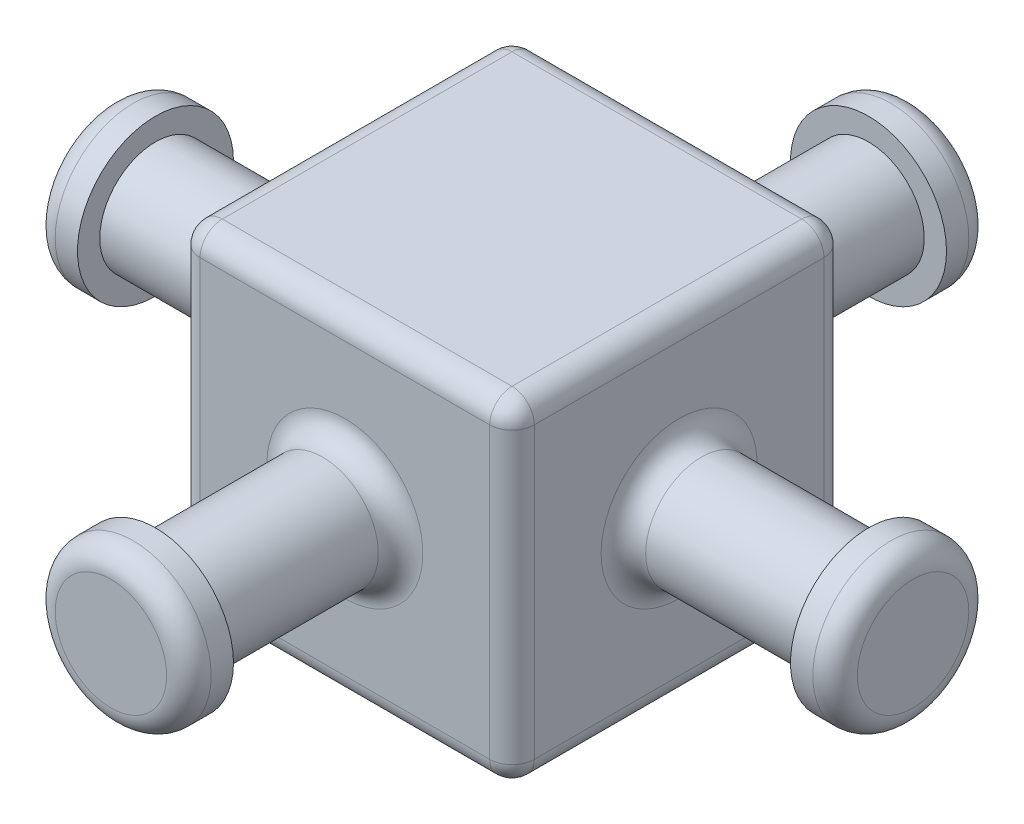
ISO-10303-21;
HEADER;
FILE_DESCRIPTION(('STEP AP214'),'2;1');
FILE_NAME('part.step','',(''),(''),'','','');
FILE_SCHEMA(('AUTOMOTIVE_DESIGN { 1 0 10303 214 1 1 1 1 }'));
ENDSEC;
DATA;
#1=APPLICATION_CONTEXT('core data for automotive mechanical design processes');
#2=APPLICATION_PROTOCOL_DEFINITION('international standard','automotive_design',2000,#1);
#3=PRODUCT_CONTEXT('',#1,'mechanical');
#4=PRODUCT('Part','Part','',(#3));
#5=PRODUCT_RELATED_PRODUCT_CATEGORY('part','',(#4));
#6=PRODUCT_DEFINITION_FORMATION('','',#4);
#7=PRODUCT_DEFINITION_CONTEXT('part definition',#1,'design');
#8=PRODUCT_DEFINITION('design','',#6,#7);
#9=PRODUCT_DEFINITION_SHAPE('','',#8);
#10=(LENGTH_UNIT() NAMED_UNIT(*) SI_UNIT(.MILLI.,.METRE.));
#11=(NAMED_UNIT(*) PLANE_ANGLE_UNIT() SI_UNIT($,.RADIAN.));
#12=(NAMED_UNIT(*) SI_UNIT($,.STERADIAN.) SOLID_ANGLE_UNIT());
#13=UNCERTAINTY_MEASURE_WITH_UNIT(LENGTH_MEASURE(1.E-05),#10,'distance_accuracy_value','');
#14=(GEOMETRIC_REPRESENTATION_CONTEXT(3) GLOBAL_UNCERTAINTY_ASSIGNED_CONTEXT((#13)) GLOBAL_UNIT_ASSIGNED_CONTEXT((#10,
#11,#12)) REPRESENTATION_CONTEXT('',''));
#15=CARTESIAN_POINT('',(0.,0.,0.));
#16=DIRECTION('',(0.,0.,1.));
#17=DIRECTION('',(1.,0.,0.));
#18=AXIS2_PLACEMENT_3D('',#15,#16,#17);
#19=CARTESIAN_POINT('',(0.,0.,20.32));
#20=DIRECTION('',(0.,0.,-1.));
#21=DIRECTION('',(-1.,0.,0.));
#22=AXIS2_PLACEMENT_3D('',#19,#20,#21);
#23=CYLINDRICAL_SURFACE('',#22,3.175);
#24=CARTESIAN_POINT('',(0.,0.,10.795));
#25=DIRECTION('',(0.,0.,-1.));
#26=DIRECTION('',(-1.,0.,0.));
#27=AXIS2_PLACEMENT_3D('',#24,#25,#26);
#28=CIRCLE('',#27,3.175);
#29=CARTESIAN_POINT('',(-3.175,0.,10.795));
#30=VERTEX_POINT('',#29);
#31=EDGE_CURVE('E165',#30,#30,#28,.F.);
#32=ORIENTED_EDGE('',*,*,#31,.T.);
#33=EDGE_LOOP('',(#32));
#34=FACE_BOUND('',#33,.T.);
#35=CARTESIAN_POINT('',(0.,0.,20.32));
#36=DIRECTION('',(0.,0.,1.));
#37=DIRECTION('',(1.,0.,0.));
#38=AXIS2_PLACEMENT_3D('',#35,#36,#37);
#39=CIRCLE('',#38,3.175);
#40=CARTESIAN_POINT('',(3.175,0.,20.32));
#41=VERTEX_POINT('',#40);
#42=EDGE_CURVE('E308',#41,#41,#39,.T.);
#43=ORIENTED_EDGE('',*,*,#42,.F.);
#44=EDGE_LOOP('',(#43));
#45=FACE_BOUND('',#44,.T.);
#46=ADVANCED_FACE('F34',(#34,#45),#23,.T.);
#47=CARTESIAN_POINT('',(0.,0.,20.32));
#48=DIRECTION('',(0.,0.,1.));
#49=DIRECTION('',(1.,0.,0.));
#50=AXIS2_PLACEMENT_3D('',#47,#48,#49);
#51=PLANE('',#50);
#52=CARTESIAN_POINT('',(0.,0.,20.32));
#53=DIRECTION('',(0.,0.,1.));
#54=DIRECTION('',(1.,0.,0.));
#55=AXIS2_PLACEMENT_3D('',#52,#53,#54);
#56=CIRCLE('',#55,4.445);
#57=CARTESIAN_POINT('',(4.445,0.,20.32));
#58=VERTEX_POINT('',#57);
#59=EDGE_CURVE('E305',#58,#58,#56,.T.);
#60=ORIENTED_EDGE('',*,*,#59,.F.);
#61=EDGE_LOOP('',(#60));
#62=FACE_BOUND('',#61,.T.);
#63=ORIENTED_EDGE('',*,*,#42,.T.);
#64=EDGE_LOOP('',(#63));
#65=FACE_BOUND('',#64,.T.);
#66=ADVANCED_FACE('F387',(#62,#65),#51,.F.);
#67=CARTESIAN_POINT('',(0.,0.,22.86));
#68=DIRECTION('',(0.,0.,-1.));
#69=DIRECTION('',(-1.,0.,0.));
#70=AXIS2_PLACEMENT_3D('',#67,#68,#69);
#71=CYLINDRICAL_SURFACE('',#70,4.445);
#72=CARTESIAN_POINT('',(0.,0.,21.59));
#73=DIRECTION('',(0.,0.,1.));
#74=DIRECTION('',(1.,0.,0.));
#75=AXIS2_PLACEMENT_3D('',#72,#73,#74);
#76=CIRCLE('',#75,4.445);
#77=CARTESIAN_POINT('',(4.445,0.,21.59));
#78=VERTEX_POINT('',#77);
#79=EDGE_CURVE('E314',#78,#78,#76,.F.);
#80=ORIENTED_EDGE('',*,*,#79,.T.);
#81=EDGE_LOOP('',(#80));
#82=FACE_BOUND('',#81,.T.);
#83=ORIENTED_EDGE('',*,*,#59,.T.);
#84=EDGE_LOOP('',(#83));
#85=FACE_BOUND('',#84,.T.);
#86=ADVANCED_FACE('F394',(#82,#85),#71,.T.);
#87=CARTESIAN_POINT('',(0.,0.,22.86));
#88=DIRECTION('',(0.,0.,1.));
#89=DIRECTION('',(1.,0.,0.));
#90=AXIS2_PLACEMENT_3D('',#87,#88,#89);
#91=PLANE('',#90);
#92=CARTESIAN_POINT('',(0.,0.,22.86));
#93=DIRECTION('',(0.,0.,1.));
#94=DIRECTION('',(1.,0.,0.));
#95=AXIS2_PLACEMENT_3D('',#92,#93,#94);
#96=CIRCLE('',#95,3.175);
#97=CARTESIAN_POINT('',(3.175,0.,22.86));
#98=VERTEX_POINT('',#97);
#99=EDGE_CURVE('E311',#98,#98,#96,.T.);
#100=ORIENTED_EDGE('',*,*,#99,.T.);
#101=EDGE_LOOP('',(#100));
#102=FACE_BOUND('',#101,.T.);
#103=ADVANCED_FACE('F511',(#102),#91,.T.);
#104=CARTESIAN_POINT('',(0.,0.,21.59));
#105=DIRECTION('',(0.,0.,1.));
#106=DIRECTION('',(1.,0.,0.));
#107=AXIS2_PLACEMENT_3D('',#104,#105,#106);
#108=TOROIDAL_SURFACE('',#107,3.175,1.27);
#109=ORIENTED_EDGE('',*,*,#79,.F.);
#110=EDGE_LOOP('',(#109));
#111=FACE_BOUND('',#110,.T.);
#112=ORIENTED_EDGE('',*,*,#99,.F.);
#113=EDGE_LOOP('',(#112));
#114=FACE_BOUND('',#113,.T.);
#115=ADVANCED_FACE('F513',(#111,#114),#108,.T.);
#116=CARTESIAN_POINT('',(9.525,-9.525,9.525));
#117=DIRECTION('',(0.,0.,-1.));
#118=DIRECTION('',(-1.,0.,0.));
#119=AXIS2_PLACEMENT_3D('',#116,#117,#118);
#120=PLANE('',#119);
#121=CARTESIAN_POINT('',(0.,0.,9.525));
#122=DIRECTION('',(0.,0.,-1.));
#123=DIRECTION('',(-1.,0.,0.));
#124=AXIS2_PLACEMENT_3D('',#121,#122,#123);
#125=CIRCLE('',#124,4.445);
#126=CARTESIAN_POINT('',(-4.445,0.,9.525));
#127=VERTEX_POINT('',#126);
#128=EDGE_CURVE('E162',#127,#127,#125,.T.);
#129=ORIENTED_EDGE('',*,*,#128,.T.);
#130=EDGE_LOOP('',(#129));
#131=FACE_BOUND('',#130,.T.);
#132=DIRECTION('',(0.,-1.,0.));
#133=VECTOR('',#132,1.);
#134=CARTESIAN_POINT('',(-8.255,-9.525,9.525));
#135=LINE('',#134,#133);
#136=CARTESIAN_POINT('',(-8.255,8.255,9.525));
#137=VERTEX_POINT('',#136);
#138=CARTESIAN_POINT('',(-8.255,-8.255,9.525));
#139=VERTEX_POINT('',#138);
#140=EDGE_CURVE('E160',#137,#139,#135,.T.);
#141=ORIENTED_EDGE('',*,*,#140,.T.);
#142=DIRECTION('',(-1.,0.,0.));
#143=VECTOR('',#142,1.);
#144=CARTESIAN_POINT('',(9.525,-8.255,9.525));
#145=LINE('',#144,#143);
#146=CARTESIAN_POINT('',(8.255,-8.255,9.525));
#147=VERTEX_POINT('',#146);
#148=EDGE_CURVE('E130',#139,#147,#145,.F.);
#149=ORIENTED_EDGE('',*,*,#148,.T.);
#150=DIRECTION('',(0.,-1.,0.));
#151=VECTOR('',#150,1.);
#152=CARTESIAN_POINT('',(8.255,-9.525,9.525));
#153=LINE('',#152,#151);
#154=CARTESIAN_POINT('',(8.255,8.255,9.525));
#155=VERTEX_POINT('',#154);
#156=EDGE_CURVE('E149',#147,#155,#153,.F.);
#157=ORIENTED_EDGE('',*,*,#156,.T.);
#158=DIRECTION('',(-1.,0.,0.));
#159=VECTOR('',#158,1.);
#160=CARTESIAN_POINT('',(9.525,8.255,9.525));
#161=LINE('',#160,#159);
#162=EDGE_CURVE('E155',#155,#137,#161,.T.);
#163=ORIENTED_EDGE('',*,*,#162,.T.);
#164=EDGE_LOOP('',(#141,#149,#157,#163));
#165=FACE_BOUND('',#164,.T.);
#166=ADVANCED_FACE('F158',(#131,#165),#120,.F.);
#167=CARTESIAN_POINT('',(-9.525,0.,0.));
#168=DIRECTION('',(-1.,0.,0.));
#169=DIRECTION('',(0.,0.,1.));
#170=AXIS2_PLACEMENT_3D('',#167,#168,#169);
#171=PLANE('',#170);
#172=CARTESIAN_POINT('',(-9.525,0.,0.));
#173=DIRECTION('',(-1.,0.,0.));
#174=DIRECTION('',(0.,0.,1.));
#175=AXIS2_PLACEMENT_3D('',#172,#173,#174);
#176=CIRCLE('',#175,4.445);
#177=CARTESIAN_POINT('',(-9.525,0.,4.445));
#178=VERTEX_POINT('',#177);
#179=EDGE_CURVE('E191',#178,#178,#176,.F.);
#180=ORIENTED_EDGE('',*,*,#179,.T.);
#181=EDGE_LOOP('',(#180));
#182=FACE_BOUND('',#181,.T.);
#183=DIRECTION('',(0.,0.,-1.));
#184=VECTOR('',#183,1.);
#185=CARTESIAN_POINT('',(-9.525,-8.255,9.525));
#186=LINE('',#185,#184);
#187=CARTESIAN_POINT('',(-9.525,-8.255,-8.255));
#188=VERTEX_POINT('',#187);
#189=CARTESIAN_POINT('',(-9.525,-8.255,8.255));
#190=VERTEX_POINT('',#189);
#191=EDGE_CURVE('E186',#188,#190,#186,.F.);
#192=ORIENTED_EDGE('',*,*,#191,.T.);
#193=DIRECTION('',(0.,-1.,0.));
#194=VECTOR('',#193,1.);
#195=CARTESIAN_POINT('',(-9.525,9.525,8.255));
#196=LINE('',#195,#194);
#197=CARTESIAN_POINT('',(-9.525,8.255,8.255));
#198=VERTEX_POINT('',#197);
#199=EDGE_CURVE('E188',#190,#198,#196,.F.);
#200=ORIENTED_EDGE('',*,*,#199,.T.);
#201=DIRECTION('',(0.,0.,1.));
#202=VECTOR('',#201,1.);
#203=CARTESIAN_POINT('',(-9.525,8.255,-9.525));
#204=LINE('',#203,#202);
#205=CARTESIAN_POINT('',(-9.525,8.255,-8.255));
#206=VERTEX_POINT('',#205);
#207=EDGE_CURVE('E184',#198,#206,#204,.F.);
#208=ORIENTED_EDGE('',*,*,#207,.T.);
#209=DIRECTION('',(0.,1.,0.));
#210=VECTOR('',#209,1.);
#211=CARTESIAN_POINT('',(-9.525,-9.525,-8.255));
#212=LINE('',#211,#210);
#213=EDGE_CURVE('E182',#206,#188,#212,.F.);
#214=ORIENTED_EDGE('',*,*,#213,.T.);
#215=EDGE_LOOP('',(#192,#200,#208,#214));
#216=FACE_BOUND('',#215,.T.);
#217=ADVANCED_FACE('F428',(#182,#216),#171,.T.);
#218=CARTESIAN_POINT('',(9.525,-9.525,-9.525));
#219=DIRECTION('',(0.,0.,1.));
#220=DIRECTION('',(1.,0.,0.));
#221=AXIS2_PLACEMENT_3D('',#218,#219,#220);
#222=PLANE('',#221);
#223=CARTESIAN_POINT('',(0.,0.,-9.525));
#224=DIRECTION('',(0.,0.,1.));
#225=DIRECTION('',(1.,0.,0.));
#226=AXIS2_PLACEMENT_3D('',#223,#224,#225);
#227=CIRCLE('',#226,4.445);
#228=CARTESIAN_POINT('',(4.445,0.,-9.525));
#229=VERTEX_POINT('',#228);
#230=EDGE_CURVE('E212',#229,#229,#227,.T.);
#231=ORIENTED_EDGE('',*,*,#230,.T.);
#232=EDGE_LOOP('',(#231));
#233=FACE_BOUND('',#232,.T.);
#234=DIRECTION('',(-1.,0.,0.));
#235=VECTOR('',#234,1.);
#236=CARTESIAN_POINT('',(9.525,-8.255,-9.525));
#237=LINE('',#236,#235);
#238=CARTESIAN_POINT('',(8.255,-8.255,-9.525));
#239=VERTEX_POINT('',#238);
#240=CARTESIAN_POINT('',(-8.255,-8.255,-9.525));
#241=VERTEX_POINT('',#240);
#242=EDGE_CURVE('E207',#239,#241,#237,.T.);
#243=ORIENTED_EDGE('',*,*,#242,.T.);
#244=DIRECTION('',(0.,1.,0.));
#245=VECTOR('',#244,1.);
#246=CARTESIAN_POINT('',(-8.255,9.525,-9.525));
#247=LINE('',#246,#245);
#248=CARTESIAN_POINT('',(-8.255,8.255,-9.525));
#249=VERTEX_POINT('',#248);
#250=EDGE_CURVE('E210',#241,#249,#247,.T.);
#251=ORIENTED_EDGE('',*,*,#250,.T.);
#252=DIRECTION('',(-1.,0.,0.));
#253=VECTOR('',#252,1.);
#254=CARTESIAN_POINT('',(9.525,8.255,-9.525));
#255=LINE('',#254,#253);
#256=CARTESIAN_POINT('',(8.255,8.255,-9.525));
#257=VERTEX_POINT('',#256);
#258=EDGE_CURVE('E205',#249,#257,#255,.F.);
#259=ORIENTED_EDGE('',*,*,#258,.T.);
#260=DIRECTION('',(0.,1.,0.));
#261=VECTOR('',#260,1.);
#262=CARTESIAN_POINT('',(8.255,-9.525,-9.525));
#263=LINE('',#262,#261);
#264=EDGE_CURVE('E203',#257,#239,#263,.F.);
#265=ORIENTED_EDGE('',*,*,#264,.T.);
#266=EDGE_LOOP('',(#243,#251,#259,#265));
#267=FACE_BOUND('',#266,.T.);
#268=ADVANCED_FACE('F425',(#233,#267),#222,.F.);
#269=CARTESIAN_POINT('',(9.525,0.,0.));
#270=DIRECTION('',(-1.,0.,0.));
#271=DIRECTION('',(0.,0.,1.));
#272=AXIS2_PLACEMENT_3D('',#269,#270,#271);
#273=PLANE('',#272);
#274=CARTESIAN_POINT('',(9.525,0.,0.));
#275=DIRECTION('',(-1.,0.,0.));
#276=DIRECTION('',(0.,0.,1.));
#277=AXIS2_PLACEMENT_3D('',#274,#275,#276);
#278=CIRCLE('',#277,4.445);
#279=CARTESIAN_POINT('',(9.525,0.,4.445));
#280=VERTEX_POINT('',#279);
#281=EDGE_CURVE('E43',#280,#280,#278,.T.);
#282=ORIENTED_EDGE('',*,*,#281,.T.);
#283=EDGE_LOOP('',(#282));
#284=FACE_BOUND('',#283,.T.);
#285=DIRECTION('',(0.,-1.,0.));
#286=VECTOR('',#285,1.);
#287=CARTESIAN_POINT('',(9.525,0.,8.255));
#288=LINE('',#287,#286);
#289=CARTESIAN_POINT('',(9.525,8.255,8.255));
#290=VERTEX_POINT('',#289);
#291=CARTESIAN_POINT('',(9.525,-8.255,8.255));
#292=VERTEX_POINT('',#291);
#293=EDGE_CURVE('E51',#290,#292,#288,.T.);
#294=ORIENTED_EDGE('',*,*,#293,.T.);
#295=DIRECTION('',(0.,0.,-1.));
#296=VECTOR('',#295,1.);
#297=CARTESIAN_POINT('',(9.525,-8.255,0.));
#298=LINE('',#297,#296);
#299=CARTESIAN_POINT('',(9.525,-8.255,-8.255));
#300=VERTEX_POINT('',#299);
#301=EDGE_CURVE('E222',#292,#300,#298,.T.);
#302=ORIENTED_EDGE('',*,*,#301,.T.);
#303=DIRECTION('',(0.,1.,0.));
#304=VECTOR('',#303,1.);
#305=CARTESIAN_POINT('',(9.525,0.,-8.255));
#306=LINE('',#305,#304);
#307=CARTESIAN_POINT('',(9.525,8.255,-8.255));
#308=VERTEX_POINT('',#307);
#309=EDGE_CURVE('E218',#300,#308,#306,.T.);
#310=ORIENTED_EDGE('',*,*,#309,.T.);
#311=DIRECTION('',(0.,0.,1.));
#312=VECTOR('',#311,1.);
#313=CARTESIAN_POINT('',(9.525,8.255,0.));
#314=LINE('',#313,#312);
#315=EDGE_CURVE('E56',#308,#290,#314,.T.);
#316=ORIENTED_EDGE('',*,*,#315,.T.);
#317=EDGE_LOOP('',(#294,#302,#310,#316));
#318=FACE_BOUND('',#317,.T.);
#319=ADVANCED_FACE('F362',(#284,#318),#273,.F.);
#320=CARTESIAN_POINT('',(9.525,9.525,9.525));
#321=DIRECTION('',(0.,-1.,0.));
#322=DIRECTION('',(0.,0.,-1.));
#323=AXIS2_PLACEMENT_3D('',#320,#321,#322);
#324=PLANE('',#323);
#325=DIRECTION('',(0.,0.,1.));
#326=VECTOR('',#325,1.);
#327=CARTESIAN_POINT('',(-8.255,9.525,9.525));
#328=LINE('',#327,#326);
#329=CARTESIAN_POINT('',(-8.255,9.525,-8.255));
#330=VERTEX_POINT('',#329);
#331=CARTESIAN_POINT('',(-8.255,9.525,8.255));
#332=VERTEX_POINT('',#331);
#333=EDGE_CURVE('E198',#330,#332,#328,.T.);
#334=ORIENTED_EDGE('',*,*,#333,.T.);
#335=DIRECTION('',(-1.,0.,0.));
#336=VECTOR('',#335,1.);
#337=CARTESIAN_POINT('',(9.525,9.525,8.255));
#338=LINE('',#337,#336);
#339=CARTESIAN_POINT('',(8.255,9.525,8.255));
#340=VERTEX_POINT('',#339);
#341=EDGE_CURVE('E200',#332,#340,#338,.F.);
#342=ORIENTED_EDGE('',*,*,#341,.T.);
#343=DIRECTION('',(0.,0.,1.));
#344=VECTOR('',#343,1.);
#345=CARTESIAN_POINT('',(8.255,9.525,9.525));
#346=LINE('',#345,#344);
#347=CARTESIAN_POINT('',(8.255,9.525,-8.255));
#348=VERTEX_POINT('',#347);
#349=EDGE_CURVE('E194',#340,#348,#346,.F.);
#350=ORIENTED_EDGE('',*,*,#349,.T.);
#351=DIRECTION('',(-1.,0.,0.));
#352=VECTOR('',#351,1.);
#353=CARTESIAN_POINT('',(9.525,9.525,-8.255));
#354=LINE('',#353,#352);
#355=EDGE_CURVE('E196',#348,#330,#354,.T.);
#356=ORIENTED_EDGE('',*,*,#355,.T.);
#357=EDGE_LOOP('',(#334,#342,#350,#356));
#358=FACE_BOUND('',#357,.T.);
#359=ADVANCED_FACE('F445',(#358),#324,.F.);
#360=CARTESIAN_POINT('',(9.525,-9.525,9.525));
#361=DIRECTION('',(0.,1.,0.));
#362=DIRECTION('',(0.,0.,1.));
#363=AXIS2_PLACEMENT_3D('',#360,#361,#362);
#364=PLANE('',#363);
#365=DIRECTION('',(0.,0.,-1.));
#366=VECTOR('',#365,1.);
#367=CARTESIAN_POINT('',(8.255,-9.525,9.525));
#368=LINE('',#367,#366);
#369=CARTESIAN_POINT('',(8.255,-9.525,-8.255));
#370=VERTEX_POINT('',#369);
#371=CARTESIAN_POINT('',(8.255,-9.525,8.255));
#372=VERTEX_POINT('',#371);
#373=EDGE_CURVE('E172',#370,#372,#368,.F.);
#374=ORIENTED_EDGE('',*,*,#373,.T.);
#375=DIRECTION('',(-1.,0.,0.));
#376=VECTOR('',#375,1.);
#377=CARTESIAN_POINT('',(9.525,-9.525,8.255));
#378=LINE('',#377,#376);
#379=CARTESIAN_POINT('',(-8.255,-9.525,8.255));
#380=VERTEX_POINT('',#379);
#381=EDGE_CURVE('E133',#372,#380,#378,.T.);
#382=ORIENTED_EDGE('',*,*,#381,.T.);
#383=DIRECTION('',(0.,0.,-1.));
#384=VECTOR('',#383,1.);
#385=CARTESIAN_POINT('',(-8.255,-9.525,-9.525));
#386=LINE('',#385,#384);
#387=CARTESIAN_POINT('',(-8.255,-9.525,-8.255));
#388=VERTEX_POINT('',#387);
#389=EDGE_CURVE('E176',#380,#388,#386,.T.);
#390=ORIENTED_EDGE('',*,*,#389,.T.);
#391=DIRECTION('',(-1.,0.,0.));
#392=VECTOR('',#391,1.);
#393=CARTESIAN_POINT('',(9.525,-9.525,-8.255));
#394=LINE('',#393,#392);
#395=EDGE_CURVE('E174',#388,#370,#394,.F.);
#396=ORIENTED_EDGE('',*,*,#395,.T.);
#397=EDGE_LOOP('',(#374,#382,#390,#396));
#398=FACE_BOUND('',#397,.T.);
#399=ADVANCED_FACE('F356',(#398),#364,.F.);
#400=CARTESIAN_POINT('',(22.86,0.,0.));
#401=DIRECTION('',(1.,0.,0.));
#402=DIRECTION('',(0.,0.,-1.));
#403=AXIS2_PLACEMENT_3D('',#400,#401,#402);
#404=PLANE('',#403);
#405=CARTESIAN_POINT('',(22.86,0.,0.));
#406=DIRECTION('',(1.,0.,0.));
#407=DIRECTION('',(0.,0.,-1.));
#408=AXIS2_PLACEMENT_3D('',#405,#406,#407);
#409=CIRCLE('',#408,3.175);
#410=CARTESIAN_POINT('',(22.86,0.,-3.175));
#411=VERTEX_POINT('',#410);
#412=EDGE_CURVE('E323',#411,#411,#409,.T.);
#413=ORIENTED_EDGE('',*,*,#412,.T.);
#414=EDGE_LOOP('',(#413));
#415=FACE_BOUND('',#414,.T.);
#416=ADVANCED_FACE('F488',(#415),#404,.T.);
#417=CARTESIAN_POINT('',(21.59,0.,0.));
#418=DIRECTION('',(1.,0.,0.));
#419=DIRECTION('',(0.,0.,-1.));
#420=AXIS2_PLACEMENT_3D('',#417,#418,#419);
#421=TOROIDAL_SURFACE('',#420,3.175,1.27);
#422=CARTESIAN_POINT('',(21.59,0.,0.));
#423=DIRECTION('',(1.,0.,0.));
#424=DIRECTION('',(0.,0.,-1.));
#425=AXIS2_PLACEMENT_3D('',#422,#423,#424);
#426=CIRCLE('',#425,4.445);
#427=CARTESIAN_POINT('',(21.59,0.,-4.445));
#428=VERTEX_POINT('',#427);
#429=EDGE_CURVE('E326',#428,#428,#426,.F.);
#430=ORIENTED_EDGE('',*,*,#429,.F.);
#431=EDGE_LOOP('',(#430));
#432=FACE_BOUND('',#431,.T.);
#433=ORIENTED_EDGE('',*,*,#412,.F.);
#434=EDGE_LOOP('',(#433));
#435=FACE_BOUND('',#434,.T.);
#436=ADVANCED_FACE('F491',(#432,#435),#421,.T.);
#437=CARTESIAN_POINT('',(22.86,0.,0.));
#438=DIRECTION('',(-1.,0.,0.));
#439=DIRECTION('',(0.,0.,1.));
#440=AXIS2_PLACEMENT_3D('',#437,#438,#439);
#441=CYLINDRICAL_SURFACE('',#440,4.445);
#442=ORIENTED_EDGE('',*,*,#429,.T.);
#443=EDGE_LOOP('',(#442));
#444=FACE_BOUND('',#443,.T.);
#445=CARTESIAN_POINT('',(20.32,0.,0.));
#446=DIRECTION('',(1.,0.,0.));
#447=DIRECTION('',(0.,0.,-1.));
#448=AXIS2_PLACEMENT_3D('',#445,#446,#447);
#449=CIRCLE('',#448,4.445);
#450=CARTESIAN_POINT('',(20.32,0.,-4.445));
#451=VERTEX_POINT('',#450);
#452=EDGE_CURVE('E291',#451,#451,#449,.T.);
#453=ORIENTED_EDGE('',*,*,#452,.T.);
#454=EDGE_LOOP('',(#453));
#455=FACE_BOUND('',#454,.T.);
#456=ADVANCED_FACE('F496',(#444,#455),#441,.T.);
#457=CARTESIAN_POINT('',(20.32,0.,0.));
#458=DIRECTION('',(1.,0.,0.));
#459=DIRECTION('',(0.,0.,-1.));
#460=AXIS2_PLACEMENT_3D('',#457,#458,#459);
#461=PLANE('',#460);
#462=ORIENTED_EDGE('',*,*,#452,.F.);
#463=EDGE_LOOP('',(#462));
#464=FACE_BOUND('',#463,.T.);
#465=CARTESIAN_POINT('',(20.32,0.,0.));
#466=DIRECTION('',(1.,0.,0.));
#467=DIRECTION('',(0.,0.,-1.));
#468=AXIS2_PLACEMENT_3D('',#465,#466,#467);
#469=CIRCLE('',#468,3.175);
#470=CARTESIAN_POINT('',(20.32,0.,-3.175));
#471=VERTEX_POINT('',#470);
#472=EDGE_CURVE('E296',#471,#471,#469,.T.);
#473=ORIENTED_EDGE('',*,*,#472,.T.);
#474=EDGE_LOOP('',(#473));
#475=FACE_BOUND('',#474,.T.);
#476=ADVANCED_FACE('F493',(#464,#475),#461,.F.);
#477=CARTESIAN_POINT('',(20.32,0.,0.));
#478=DIRECTION('',(-1.,0.,0.));
#479=DIRECTION('',(0.,0.,1.));
#480=AXIS2_PLACEMENT_3D('',#477,#478,#479);
#481=CYLINDRICAL_SURFACE('',#480,3.175);
#482=CARTESIAN_POINT('',(10.795,0.,0.));
#483=DIRECTION('',(-1.,0.,0.));
#484=DIRECTION('',(0.,0.,1.));
#485=AXIS2_PLACEMENT_3D('',#482,#483,#484);
#486=CIRCLE('',#485,3.175);
#487=CARTESIAN_POINT('',(10.795,0.,3.175));
#488=VERTEX_POINT('',#487);
#489=EDGE_CURVE('E11',#488,#488,#486,.F.);
#490=ORIENTED_EDGE('',*,*,#489,.T.);
#491=EDGE_LOOP('',(#490));
#492=FACE_BOUND('',#491,.T.);
#493=ORIENTED_EDGE('',*,*,#472,.F.);
#494=EDGE_LOOP('',(#493));
#495=FACE_BOUND('',#494,.T.);
#496=ADVANCED_FACE('F476',(#492,#495),#481,.T.);
#497=CARTESIAN_POINT('',(0.,0.,-22.86));
#498=DIRECTION('',(0.,0.,-1.));
#499=DIRECTION('',(1.,0.,0.));
#500=AXIS2_PLACEMENT_3D('',#497,#498,#499);
#501=PLANE('',#500);
#502=CARTESIAN_POINT('',(0.,0.,-22.86));
#503=DIRECTION('',(0.,0.,-1.));
#504=DIRECTION('',(-1.,0.,0.));
#505=AXIS2_PLACEMENT_3D('',#502,#503,#504);
#506=CIRCLE('',#505,3.175);
#507=CARTESIAN_POINT('',(-3.175,0.,-22.86));
#508=VERTEX_POINT('',#507);
#509=EDGE_CURVE('E320',#508,#508,#506,.T.);
#510=ORIENTED_EDGE('',*,*,#509,.T.);
#511=EDGE_LOOP('',(#510));
#512=FACE_BOUND('',#511,.T.);
#513=ADVANCED_FACE('F502',(#512),#501,.T.);
#514=CARTESIAN_POINT('',(0.,0.,-21.59));
#515=DIRECTION('',(0.,0.,-1.));
#516=DIRECTION('',(-1.,0.,0.));
#517=AXIS2_PLACEMENT_3D('',#514,#515,#516);
#518=TOROIDAL_SURFACE('',#517,3.175,1.27);
#519=ORIENTED_EDGE('',*,*,#509,.F.);
#520=EDGE_LOOP('',(#519));
#521=FACE_BOUND('',#520,.T.);
#522=CARTESIAN_POINT('',(0.,0.,-21.59));
#523=DIRECTION('',(0.,0.,-1.));
#524=DIRECTION('',(-1.,0.,0.));
#525=AXIS2_PLACEMENT_3D('',#522,#523,#524);
#526=CIRCLE('',#525,4.445);
#527=CARTESIAN_POINT('',(-4.445,0.,-21.59));
#528=VERTEX_POINT('',#527);
#529=EDGE_CURVE('E317',#528,#528,#526,.F.);
#530=ORIENTED_EDGE('',*,*,#529,.F.);
#531=EDGE_LOOP('',(#530));
#532=FACE_BOUND('',#531,.T.);
#533=ADVANCED_FACE('F505',(#521,#532),#518,.T.);
#534=CARTESIAN_POINT('',(0.,0.,-22.86));
#535=DIRECTION('',(0.,0.,1.));
#536=DIRECTION('',(1.,0.,0.));
#537=AXIS2_PLACEMENT_3D('',#534,#535,#536);
#538=CYLINDRICAL_SURFACE('',#537,4.445);
#539=ORIENTED_EDGE('',*,*,#529,.T.);
#540=EDGE_LOOP('',(#539));
#541=FACE_BOUND('',#540,.T.);
#542=CARTESIAN_POINT('',(0.,0.,-20.32));
#543=DIRECTION('',(0.,0.,1.));
#544=DIRECTION('',(1.,0.,0.));
#545=AXIS2_PLACEMENT_3D('',#542,#543,#544);
#546=CIRCLE('',#545,4.445);
#547=CARTESIAN_POINT('',(4.445,0.,-20.32));
#548=VERTEX_POINT('',#547);
#549=EDGE_CURVE('E299',#548,#548,#546,.T.);
#550=ORIENTED_EDGE('',*,*,#549,.F.);
#551=EDGE_LOOP('',(#550));
#552=FACE_BOUND('',#551,.T.);
#553=ADVANCED_FACE('F411',(#541,#552),#538,.T.);
#554=CARTESIAN_POINT('',(0.,0.,-20.32));
#555=DIRECTION('',(0.,0.,-1.));
#556=DIRECTION('',(1.,0.,0.));
#557=AXIS2_PLACEMENT_3D('',#554,#555,#556);
#558=PLANE('',#557);
#559=ORIENTED_EDGE('',*,*,#549,.T.);
#560=EDGE_LOOP('',(#559));
#561=FACE_BOUND('',#560,.T.);
#562=CARTESIAN_POINT('',(0.,0.,-20.32));
#563=DIRECTION('',(0.,0.,-1.));
#564=DIRECTION('',(-1.,0.,0.));
#565=AXIS2_PLACEMENT_3D('',#562,#563,#564);
#566=CIRCLE('',#565,3.175);
#567=CARTESIAN_POINT('',(-3.175,0.,-20.32));
#568=VERTEX_POINT('',#567);
#569=EDGE_CURVE('E302',#568,#568,#566,.T.);
#570=ORIENTED_EDGE('',*,*,#569,.T.);
#571=EDGE_LOOP('',(#570));
#572=FACE_BOUND('',#571,.T.);
#573=ADVANCED_FACE('F402',(#561,#572),#558,.F.);
#574=CARTESIAN_POINT('',(0.,0.,-10.795));
#575=DIRECTION('',(0.,0.,1.));
#576=DIRECTION('',(1.,0.,0.));
#577=AXIS2_PLACEMENT_3D('',#574,#575,#576);
#578=CIRCLE('',#577,3.175);
#579=CARTESIAN_POINT('',(3.175,0.,-10.795));
#580=VERTEX_POINT('',#579);
#581=EDGE_CURVE('E215',#580,#580,#578,.F.);
#582=ORIENTED_EDGE('',*,*,#581,.T.);
#583=EDGE_LOOP('',(#582));
#584=FACE_BOUND('',#583,.T.);
#585=ORIENTED_EDGE('',*,*,#569,.F.);
#586=EDGE_LOOP('',(#585));
#587=FACE_BOUND('',#586,.T.);
#588=ADVANCED_FACE('F390',(#584,#587),#23,.T.);
#589=CARTESIAN_POINT('',(-22.86,0.,0.));
#590=DIRECTION('',(-1.,0.,0.));
#591=DIRECTION('',(0.,0.,-1.));
#592=AXIS2_PLACEMENT_3D('',#589,#590,#591);
#593=PLANE('',#592);
#594=CARTESIAN_POINT('',(-22.86,0.,0.));
#595=DIRECTION('',(-1.,0.,0.));
#596=DIRECTION('',(0.,0.,1.));
#597=AXIS2_PLACEMENT_3D('',#594,#595,#596);
#598=CIRCLE('',#597,3.175);
#599=CARTESIAN_POINT('',(-22.86,0.,3.175));
#600=VERTEX_POINT('',#599);
#601=EDGE_CURVE('E156',#600,#600,#598,.T.);
#602=ORIENTED_EDGE('',*,*,#601,.T.);
#603=EDGE_LOOP('',(#602));
#604=FACE_BOUND('',#603,.T.);
#605=ADVANCED_FACE('F401',(#604),#593,.T.);
#606=CARTESIAN_POINT('',(-21.59,0.,0.));
#607=DIRECTION('',(-1.,0.,0.));
#608=DIRECTION('',(0.,0.,1.));
#609=AXIS2_PLACEMENT_3D('',#606,#607,#608);
#610=TOROIDAL_SURFACE('',#609,3.175,1.27);
#611=ORIENTED_EDGE('',*,*,#601,.F.);
#612=EDGE_LOOP('',(#611));
#613=FACE_BOUND('',#612,.T.);
#614=CARTESIAN_POINT('',(-21.59,0.,0.));
#615=DIRECTION('',(-1.,0.,0.));
#616=DIRECTION('',(0.,0.,1.));
#617=AXIS2_PLACEMENT_3D('',#614,#615,#616);
#618=CIRCLE('',#617,4.445);
#619=CARTESIAN_POINT('',(-21.59,0.,4.445));
#620=VERTEX_POINT('',#619);
#621=EDGE_CURVE('E329',#620,#620,#618,.F.);
#622=ORIENTED_EDGE('',*,*,#621,.F.);
#623=EDGE_LOOP('',(#622));
#624=FACE_BOUND('',#623,.T.);
#625=ADVANCED_FACE('F408',(#613,#624),#610,.T.);
#626=CARTESIAN_POINT('',(-22.86,0.,0.));
#627=DIRECTION('',(1.,0.,0.));
#628=DIRECTION('',(0.,0.,-1.));
#629=AXIS2_PLACEMENT_3D('',#626,#627,#628);
#630=CYLINDRICAL_SURFACE('',#629,4.445);
#631=ORIENTED_EDGE('',*,*,#621,.T.);
#632=EDGE_LOOP('',(#631));
#633=FACE_BOUND('',#632,.T.);
#634=CARTESIAN_POINT('',(-20.32,0.,0.));
#635=DIRECTION('',(1.,0.,0.));
#636=DIRECTION('',(0.,0.,-1.));
#637=AXIS2_PLACEMENT_3D('',#634,#635,#636);
#638=CIRCLE('',#637,4.445);
#639=CARTESIAN_POINT('',(-20.32,0.,-4.445));
#640=VERTEX_POINT('',#639);
#641=EDGE_CURVE('E280',#640,#640,#638,.T.);
#642=ORIENTED_EDGE('',*,*,#641,.F.);
#643=EDGE_LOOP('',(#642));
#644=FACE_BOUND('',#643,.T.);
#645=ADVANCED_FACE('F480',(#633,#644),#630,.T.);
#646=CARTESIAN_POINT('',(-20.32,0.,0.));
#647=DIRECTION('',(-1.,0.,0.));
#648=DIRECTION('',(0.,0.,-1.));
#649=AXIS2_PLACEMENT_3D('',#646,#647,#648);
#650=PLANE('',#649);
#651=ORIENTED_EDGE('',*,*,#641,.T.);
#652=EDGE_LOOP('',(#651));
#653=FACE_BOUND('',#652,.T.);
#654=CARTESIAN_POINT('',(-20.32,0.,0.));
#655=DIRECTION('',(-1.,0.,0.));
#656=DIRECTION('',(0.,0.,1.));
#657=AXIS2_PLACEMENT_3D('',#654,#655,#656);
#658=CIRCLE('',#657,3.175);
#659=CARTESIAN_POINT('',(-20.32,0.,3.175));
#660=VERTEX_POINT('',#659);
#661=EDGE_CURVE('E286',#660,#660,#658,.T.);
#662=ORIENTED_EDGE('',*,*,#661,.T.);
#663=EDGE_LOOP('',(#662));
#664=FACE_BOUND('',#663,.T.);
#665=ADVANCED_FACE('F474',(#653,#664),#650,.F.);
#666=CARTESIAN_POINT('',(-10.795,0.,0.));
#667=DIRECTION('',(-1.,0.,0.));
#668=DIRECTION('',(0.,0.,1.));
#669=AXIS2_PLACEMENT_3D('',#666,#667,#668);
#670=CIRCLE('',#669,3.175);
#671=CARTESIAN_POINT('',(-10.795,0.,3.175));
#672=VERTEX_POINT('',#671);
#673=EDGE_CURVE('E179',#672,#672,#670,.T.);
#674=ORIENTED_EDGE('',*,*,#673,.T.);
#675=EDGE_LOOP('',(#674));
#676=FACE_BOUND('',#675,.T.);
#677=ORIENTED_EDGE('',*,*,#661,.F.);
#678=EDGE_LOOP('',(#677));
#679=FACE_BOUND('',#678,.T.);
#680=ADVANCED_FACE('F457',(#676,#679),#481,.T.);
#681=CARTESIAN_POINT('',(0.,0.,10.795));
#682=DIRECTION('',(0.,0.,-1.));
#683=DIRECTION('',(-1.,0.,0.));
#684=AXIS2_PLACEMENT_3D('',#681,#682,#683);
#685=TOROIDAL_SURFACE('',#684,4.445,1.27);
#686=ORIENTED_EDGE('',*,*,#31,.F.);
#687=EDGE_LOOP('',(#686));
#688=FACE_BOUND('',#687,.T.);
#689=ORIENTED_EDGE('',*,*,#128,.F.);
#690=EDGE_LOOP('',(#689));
#691=FACE_BOUND('',#690,.T.);
#692=ADVANCED_FACE('F450',(#688,#691),#685,.F.);
#693=CARTESIAN_POINT('',(9.525,8.255,-8.255));
#694=DIRECTION('',(-1.,0.,0.));
#695=DIRECTION('',(0.,0.,1.));
#696=AXIS2_PLACEMENT_3D('',#693,#694,#695);
#697=CYLINDRICAL_SURFACE('',#696,1.27);
#698=CARTESIAN_POINT('',(8.255,8.255,-8.255));
#699=DIRECTION('',(1.,0.,0.));
#700=DIRECTION('',(0.,0.,-1.));
#701=AXIS2_PLACEMENT_3D('',#698,#699,#700);
#702=CIRCLE('',#701,1.27);
#703=EDGE_CURVE('E38',#257,#348,#702,.T.);
#704=ORIENTED_EDGE('',*,*,#703,.F.);
#705=ORIENTED_EDGE('',*,*,#258,.F.);
#706=CARTESIAN_POINT('',(-8.255,8.255,-8.255));
#707=DIRECTION('',(-1.,0.,0.));
#708=DIRECTION('',(0.,0.,1.));
#709=AXIS2_PLACEMENT_3D('',#706,#707,#708);
#710=CIRCLE('',#709,1.27);
#711=EDGE_CURVE('E273',#330,#249,#710,.T.);
#712=ORIENTED_EDGE('',*,*,#711,.F.);
#713=ORIENTED_EDGE('',*,*,#355,.F.);
#714=EDGE_LOOP('',(#704,#705,#712,#713));
#715=FACE_BOUND('',#714,.T.);
#716=ADVANCED_FACE('F448',(#715),#697,.T.);
#717=CARTESIAN_POINT('',(8.255,8.255,-8.255));
#718=DIRECTION('',(0.,0.,1.));
#719=DIRECTION('',(1.,0.,0.));
#720=AXIS2_PLACEMENT_3D('',#717,#718,#719);
#721=SPHERICAL_SURFACE('',#720,1.27);
#722=CARTESIAN_POINT('',(8.255,8.255,-8.255));
#723=DIRECTION('',(0.,1.,0.));
#724=DIRECTION('',(0.,0.,1.));
#725=AXIS2_PLACEMENT_3D('',#722,#723,#724);
#726=CIRCLE('',#725,1.27);
#727=EDGE_CURVE('E268',#257,#308,#726,.F.);
#728=ORIENTED_EDGE('',*,*,#727,.F.);
#729=ORIENTED_EDGE('',*,*,#703,.T.);
#730=CARTESIAN_POINT('',(8.255,8.255,-8.255));
#731=DIRECTION('',(0.,0.,-1.));
#732=DIRECTION('',(-1.,0.,0.));
#733=AXIS2_PLACEMENT_3D('',#730,#731,#732);
#734=CIRCLE('',#733,1.27);
#735=EDGE_CURVE('E271',#308,#348,#734,.F.);
#736=ORIENTED_EDGE('',*,*,#735,.F.);
#737=EDGE_LOOP('',(#728,#729,#736));
#738=FACE_BOUND('',#737,.T.);
#739=ADVANCED_FACE('F368',(#738),#721,.T.);
#740=CARTESIAN_POINT('',(-8.255,8.255,-8.255));
#741=DIRECTION('',(0.,0.,1.));
#742=DIRECTION('',(1.,0.,0.));
#743=AXIS2_PLACEMENT_3D('',#740,#741,#742);
#744=SPHERICAL_SURFACE('',#743,1.27);
#745=CARTESIAN_POINT('',(-8.255,8.255,-8.255));
#746=DIRECTION('',(0.,0.,-1.));
#747=DIRECTION('',(-1.,0.,0.));
#748=AXIS2_PLACEMENT_3D('',#745,#746,#747);
#749=CIRCLE('',#748,1.27);
#750=EDGE_CURVE('E262',#330,#206,#749,.F.);
#751=ORIENTED_EDGE('',*,*,#750,.F.);
#752=ORIENTED_EDGE('',*,*,#711,.T.);
#753=CARTESIAN_POINT('',(-8.255,8.255,-8.255));
#754=DIRECTION('',(0.,1.,0.));
#755=DIRECTION('',(0.,0.,1.));
#756=AXIS2_PLACEMENT_3D('',#753,#754,#755);
#757=CIRCLE('',#756,1.27);
#758=EDGE_CURVE('E265',#206,#249,#757,.F.);
#759=ORIENTED_EDGE('',*,*,#758,.F.);
#760=EDGE_LOOP('',(#751,#752,#759));
#761=FACE_BOUND('',#760,.T.);
#762=ADVANCED_FACE('F441',(#761),#744,.T.);
#763=CARTESIAN_POINT('',(8.255,8.255,0.));
#764=DIRECTION('',(0.,0.,1.));
#765=DIRECTION('',(1.,0.,0.));
#766=AXIS2_PLACEMENT_3D('',#763,#764,#765);
#767=CYLINDRICAL_SURFACE('',#766,1.27);
#768=ORIENTED_EDGE('',*,*,#735,.T.);
#769=ORIENTED_EDGE('',*,*,#349,.F.);
#770=CARTESIAN_POINT('',(8.255,8.255,8.255));
#771=DIRECTION('',(0.,0.,1.));
#772=DIRECTION('',(1.,0.,0.));
#773=AXIS2_PLACEMENT_3D('',#770,#771,#772);
#774=CIRCLE('',#773,1.27);
#775=EDGE_CURVE('E257',#290,#340,#774,.T.);
#776=ORIENTED_EDGE('',*,*,#775,.F.);
#777=ORIENTED_EDGE('',*,*,#315,.F.);
#778=EDGE_LOOP('',(#768,#769,#776,#777));
#779=FACE_BOUND('',#778,.T.);
#780=ADVANCED_FACE('F371',(#779),#767,.T.);
#781=CARTESIAN_POINT('',(8.255,0.,-8.255));
#782=DIRECTION('',(0.,1.,0.));
#783=DIRECTION('',(0.,0.,1.));
#784=AXIS2_PLACEMENT_3D('',#781,#782,#783);
#785=CYLINDRICAL_SURFACE('',#784,1.27);
#786=ORIENTED_EDGE('',*,*,#727,.T.);
#787=ORIENTED_EDGE('',*,*,#309,.F.);
#788=CARTESIAN_POINT('',(8.255,-8.255,-8.255));
#789=DIRECTION('',(0.,-1.,0.));
#790=DIRECTION('',(0.,0.,-1.));
#791=AXIS2_PLACEMENT_3D('',#788,#789,#790);
#792=CIRCLE('',#791,1.27);
#793=EDGE_CURVE('E254',#239,#300,#792,.T.);
#794=ORIENTED_EDGE('',*,*,#793,.F.);
#795=ORIENTED_EDGE('',*,*,#264,.F.);
#796=EDGE_LOOP('',(#786,#787,#794,#795));
#797=FACE_BOUND('',#796,.T.);
#798=ADVANCED_FACE('F367',(#797),#785,.T.);
#799=CARTESIAN_POINT('',(9.525,-8.255,-8.255));
#800=DIRECTION('',(-1.,0.,0.));
#801=DIRECTION('',(0.,0.,1.));
#802=AXIS2_PLACEMENT_3D('',#799,#800,#801);
#803=CYLINDRICAL_SURFACE('',#802,1.27);
#804=CARTESIAN_POINT('',(-8.255,-8.255,-8.255));
#805=DIRECTION('',(-1.,0.,0.));
#806=DIRECTION('',(0.,0.,1.));
#807=AXIS2_PLACEMENT_3D('',#804,#805,#806);
#808=CIRCLE('',#807,1.27);
#809=EDGE_CURVE('E248',#241,#388,#808,.T.);
#810=ORIENTED_EDGE('',*,*,#809,.F.);
#811=ORIENTED_EDGE('',*,*,#242,.F.);
#812=CARTESIAN_POINT('',(8.255,-8.255,-8.255));
#813=DIRECTION('',(1.,0.,0.));
#814=DIRECTION('',(0.,0.,-1.));
#815=AXIS2_PLACEMENT_3D('',#812,#813,#814);
#816=CIRCLE('',#815,1.27);
#817=EDGE_CURVE('E251',#370,#239,#816,.T.);
#818=ORIENTED_EDGE('',*,*,#817,.F.);
#819=ORIENTED_EDGE('',*,*,#395,.F.);
#820=EDGE_LOOP('',(#810,#811,#818,#819));
#821=FACE_BOUND('',#820,.T.);
#822=ADVANCED_FACE('F435',(#821),#803,.T.);
#823=CARTESIAN_POINT('',(-8.255,-9.525,-8.255));
#824=DIRECTION('',(0.,-1.,0.));
#825=DIRECTION('',(0.,0.,-1.));
#826=AXIS2_PLACEMENT_3D('',#823,#824,#825);
#827=CYLINDRICAL_SURFACE('',#826,1.27);
#828=ORIENTED_EDGE('',*,*,#758,.T.);
#829=ORIENTED_EDGE('',*,*,#250,.F.);
#830=CARTESIAN_POINT('',(-8.255,-8.255,-8.255));
#831=DIRECTION('',(0.,-1.,0.));
#832=DIRECTION('',(0.,0.,-1.));
#833=AXIS2_PLACEMENT_3D('',#830,#831,#832);
#834=CIRCLE('',#833,1.27);
#835=EDGE_CURVE('E246',#188,#241,#834,.T.);
#836=ORIENTED_EDGE('',*,*,#835,.F.);
#837=ORIENTED_EDGE('',*,*,#213,.F.);
#838=EDGE_LOOP('',(#828,#829,#836,#837));
#839=FACE_BOUND('',#838,.T.);
#840=ADVANCED_FACE('F439',(#839),#827,.T.);
#841=CARTESIAN_POINT('',(-8.255,8.255,9.525));
#842=DIRECTION('',(0.,0.,-1.));
#843=DIRECTION('',(-1.,0.,0.));
#844=AXIS2_PLACEMENT_3D('',#841,#842,#843);
#845=CYLINDRICAL_SURFACE('',#844,1.27);
#846=ORIENTED_EDGE('',*,*,#750,.T.);
#847=ORIENTED_EDGE('',*,*,#207,.F.);
#848=CARTESIAN_POINT('',(-8.255,8.255,8.255));
#849=DIRECTION('',(0.,0.,1.));
#850=DIRECTION('',(1.,0.,0.));
#851=AXIS2_PLACEMENT_3D('',#848,#849,#850);
#852=CIRCLE('',#851,1.27);
#853=EDGE_CURVE('E243',#332,#198,#852,.T.);
#854=ORIENTED_EDGE('',*,*,#853,.F.);
#855=ORIENTED_EDGE('',*,*,#333,.F.);
#856=EDGE_LOOP('',(#846,#847,#854,#855));
#857=FACE_BOUND('',#856,.T.);
#858=ADVANCED_FACE('F384',(#857),#845,.T.);
#859=CARTESIAN_POINT('',(9.525,8.255,8.255));
#860=DIRECTION('',(-1.,0.,0.));
#861=DIRECTION('',(0.,0.,1.));
#862=AXIS2_PLACEMENT_3D('',#859,#860,#861);
#863=CYLINDRICAL_SURFACE('',#862,1.27);
#864=CARTESIAN_POINT('',(8.255,8.255,8.255));
#865=DIRECTION('',(1.,0.,0.));
#866=DIRECTION('',(0.,0.,-1.));
#867=AXIS2_PLACEMENT_3D('',#864,#865,#866);
#868=CIRCLE('',#867,1.27);
#869=EDGE_CURVE('E259',#340,#155,#868,.T.);
#870=ORIENTED_EDGE('',*,*,#869,.F.);
#871=ORIENTED_EDGE('',*,*,#341,.F.);
#872=CARTESIAN_POINT('',(-8.255,8.255,8.255));
#873=DIRECTION('',(-1.,0.,0.));
#874=DIRECTION('',(0.,0.,1.));
#875=AXIS2_PLACEMENT_3D('',#872,#873,#874);
#876=CIRCLE('',#875,1.27);
#877=EDGE_CURVE('E240',#137,#332,#876,.T.);
#878=ORIENTED_EDGE('',*,*,#877,.F.);
#879=ORIENTED_EDGE('',*,*,#162,.F.);
#880=EDGE_LOOP('',(#870,#871,#878,#879));
#881=FACE_BOUND('',#880,.T.);
#882=ADVANCED_FACE('F338',(#881),#863,.T.);
#883=CARTESIAN_POINT('',(8.255,8.255,8.255));
#884=DIRECTION('',(0.,0.,1.));
#885=DIRECTION('',(1.,0.,0.));
#886=AXIS2_PLACEMENT_3D('',#883,#884,#885);
#887=SPHERICAL_SURFACE('',#886,1.27);
#888=ORIENTED_EDGE('',*,*,#775,.T.);
#889=ORIENTED_EDGE('',*,*,#869,.T.);
#890=CARTESIAN_POINT('',(8.255,8.255,8.255));
#891=DIRECTION('',(0.,1.,0.));
#892=DIRECTION('',(0.,0.,1.));
#893=AXIS2_PLACEMENT_3D('',#890,#891,#892);
#894=CIRCLE('',#893,1.27);
#895=EDGE_CURVE('E152',#290,#155,#894,.F.);
#896=ORIENTED_EDGE('',*,*,#895,.F.);
#897=EDGE_LOOP('',(#888,#889,#896));
#898=FACE_BOUND('',#897,.T.);
#899=ADVANCED_FACE('F373',(#898),#887,.T.);
#900=CARTESIAN_POINT('',(8.255,-8.255,-8.255));
#901=DIRECTION('',(0.,0.,1.));
#902=DIRECTION('',(1.,0.,0.));
#903=AXIS2_PLACEMENT_3D('',#900,#901,#902);
#904=SPHERICAL_SURFACE('',#903,1.27);
#905=ORIENTED_EDGE('',*,*,#817,.T.);
#906=ORIENTED_EDGE('',*,*,#793,.T.);
#907=CARTESIAN_POINT('',(8.255,-8.255,-8.255));
#908=DIRECTION('',(0.,0.,-1.));
#909=DIRECTION('',(-1.,0.,0.));
#910=AXIS2_PLACEMENT_3D('',#907,#908,#909);
#911=CIRCLE('',#910,1.27);
#912=EDGE_CURVE('E237',#370,#300,#911,.F.);
#913=ORIENTED_EDGE('',*,*,#912,.F.);
#914=EDGE_LOOP('',(#905,#906,#913));
#915=FACE_BOUND('',#914,.T.);
#916=ADVANCED_FACE('F375',(#915),#904,.T.);
#917=CARTESIAN_POINT('',(-8.255,-8.255,-8.255));
#918=DIRECTION('',(0.,0.,1.));
#919=DIRECTION('',(1.,0.,0.));
#920=AXIS2_PLACEMENT_3D('',#917,#918,#919);
#921=SPHERICAL_SURFACE('',#920,1.27);
#922=ORIENTED_EDGE('',*,*,#835,.T.);
#923=ORIENTED_EDGE('',*,*,#809,.T.);
#924=CARTESIAN_POINT('',(-8.255,-8.255,-8.255));
#925=DIRECTION('',(0.,0.,-1.));
#926=DIRECTION('',(-1.,0.,0.));
#927=AXIS2_PLACEMENT_3D('',#924,#925,#926);
#928=CIRCLE('',#927,1.27);
#929=EDGE_CURVE('E234',#188,#388,#928,.F.);
#930=ORIENTED_EDGE('',*,*,#929,.F.);
#931=EDGE_LOOP('',(#922,#923,#930));
#932=FACE_BOUND('',#931,.T.);
#933=ADVANCED_FACE('F381',(#932),#921,.T.);
#934=CARTESIAN_POINT('',(-8.255,8.255,8.255));
#935=DIRECTION('',(0.,0.,1.));
#936=DIRECTION('',(1.,0.,0.));
#937=AXIS2_PLACEMENT_3D('',#934,#935,#936);
#938=SPHERICAL_SURFACE('',#937,1.27);
#939=ORIENTED_EDGE('',*,*,#877,.T.);
#940=ORIENTED_EDGE('',*,*,#853,.T.);
#941=CARTESIAN_POINT('',(-8.255,8.255,8.255));
#942=DIRECTION('',(0.,1.,0.));
#943=DIRECTION('',(0.,0.,1.));
#944=AXIS2_PLACEMENT_3D('',#941,#942,#943);
#945=CIRCLE('',#944,1.27);
#946=EDGE_CURVE('E146',#137,#198,#945,.F.);
#947=ORIENTED_EDGE('',*,*,#946,.F.);
#948=EDGE_LOOP('',(#939,#940,#947));
#949=FACE_BOUND('',#948,.T.);
#950=ADVANCED_FACE('F341',(#949),#938,.T.);
#951=CARTESIAN_POINT('',(8.255,0.,8.255));
#952=DIRECTION('',(0.,-1.,0.));
#953=DIRECTION('',(0.,0.,-1.));
#954=AXIS2_PLACEMENT_3D('',#951,#952,#953);
#955=CYLINDRICAL_SURFACE('',#954,1.27);
#956=ORIENTED_EDGE('',*,*,#895,.T.);
#957=ORIENTED_EDGE('',*,*,#156,.F.);
#958=CARTESIAN_POINT('',(8.255,-8.255,8.255));
#959=DIRECTION('',(0.,-1.,0.));
#960=DIRECTION('',(0.,0.,-1.));
#961=AXIS2_PLACEMENT_3D('',#958,#959,#960);
#962=CIRCLE('',#961,1.27);
#963=EDGE_CURVE('E140',#292,#147,#962,.T.);
#964=ORIENTED_EDGE('',*,*,#963,.F.);
#965=ORIENTED_EDGE('',*,*,#293,.F.);
#966=EDGE_LOOP('',(#956,#957,#964,#965));
#967=FACE_BOUND('',#966,.T.);
#968=ADVANCED_FACE('F150',(#967),#955,.T.);
#969=CARTESIAN_POINT('',(8.255,-8.255,0.));
#970=DIRECTION('',(0.,0.,-1.));
#971=DIRECTION('',(-1.,0.,0.));
#972=AXIS2_PLACEMENT_3D('',#969,#970,#971);
#973=CYLINDRICAL_SURFACE('',#972,1.27);
#974=ORIENTED_EDGE('',*,*,#912,.T.);
#975=ORIENTED_EDGE('',*,*,#301,.F.);
#976=CARTESIAN_POINT('',(8.255,-8.255,8.255));
#977=DIRECTION('',(0.,0.,1.));
#978=DIRECTION('',(1.,0.,0.));
#979=AXIS2_PLACEMENT_3D('',#976,#977,#978);
#980=CIRCLE('',#979,1.27);
#981=EDGE_CURVE('E144',#372,#292,#980,.T.);
#982=ORIENTED_EDGE('',*,*,#981,.F.);
#983=ORIENTED_EDGE('',*,*,#373,.F.);
#984=EDGE_LOOP('',(#974,#975,#982,#983));
#985=FACE_BOUND('',#984,.T.);
#986=ADVANCED_FACE('F360',(#985),#973,.T.);
#987=CARTESIAN_POINT('',(-8.255,-8.255,9.525));
#988=DIRECTION('',(0.,0.,1.));
#989=DIRECTION('',(1.,0.,0.));
#990=AXIS2_PLACEMENT_3D('',#987,#988,#989);
#991=CYLINDRICAL_SURFACE('',#990,1.27);
#992=ORIENTED_EDGE('',*,*,#929,.T.);
#993=ORIENTED_EDGE('',*,*,#389,.F.);
#994=CARTESIAN_POINT('',(-8.255,-8.255,8.255));
#995=DIRECTION('',(0.,0.,1.));
#996=DIRECTION('',(1.,0.,0.));
#997=AXIS2_PLACEMENT_3D('',#994,#995,#996);
#998=CIRCLE('',#997,1.27);
#999=EDGE_CURVE('E229',#190,#380,#998,.T.);
#1000=ORIENTED_EDGE('',*,*,#999,.F.);
#1001=ORIENTED_EDGE('',*,*,#191,.F.);
#1002=EDGE_LOOP('',(#992,#993,#1000,#1001));
#1003=FACE_BOUND('',#1002,.T.);
#1004=ADVANCED_FACE('F352',(#1003),#991,.T.);
#1005=CARTESIAN_POINT('',(-8.255,-9.525,8.255));
#1006=DIRECTION('',(0.,1.,0.));
#1007=DIRECTION('',(0.,0.,1.));
#1008=AXIS2_PLACEMENT_3D('',#1005,#1006,#1007);
#1009=CYLINDRICAL_SURFACE('',#1008,1.27);
#1010=ORIENTED_EDGE('',*,*,#946,.T.);
#1011=ORIENTED_EDGE('',*,*,#199,.F.);
#1012=CARTESIAN_POINT('',(-8.255,-8.255,8.255));
#1013=DIRECTION('',(0.,-1.,0.));
#1014=DIRECTION('',(0.,0.,-1.));
#1015=AXIS2_PLACEMENT_3D('',#1012,#1013,#1014);
#1016=CIRCLE('',#1015,1.27);
#1017=EDGE_CURVE('E136',#139,#190,#1016,.T.);
#1018=ORIENTED_EDGE('',*,*,#1017,.F.);
#1019=ORIENTED_EDGE('',*,*,#140,.F.);
#1020=EDGE_LOOP('',(#1010,#1011,#1018,#1019));
#1021=FACE_BOUND('',#1020,.T.);
#1022=ADVANCED_FACE('F345',(#1021),#1009,.T.);
#1023=CARTESIAN_POINT('',(8.255,-8.255,8.255));
#1024=DIRECTION('',(0.,0.,1.));
#1025=DIRECTION('',(1.,0.,0.));
#1026=AXIS2_PLACEMENT_3D('',#1023,#1024,#1025);
#1027=SPHERICAL_SURFACE('',#1026,1.27);
#1028=ORIENTED_EDGE('',*,*,#981,.T.);
#1029=ORIENTED_EDGE('',*,*,#963,.T.);
#1030=CARTESIAN_POINT('',(8.255,-8.255,8.255));
#1031=DIRECTION('',(1.,0.,0.));
#1032=DIRECTION('',(0.,0.,-1.));
#1033=AXIS2_PLACEMENT_3D('',#1030,#1031,#1032);
#1034=CIRCLE('',#1033,1.27);
#1035=EDGE_CURVE('E126',#372,#147,#1034,.F.);
#1036=ORIENTED_EDGE('',*,*,#1035,.F.);
#1037=EDGE_LOOP('',(#1028,#1029,#1036));
#1038=FACE_BOUND('',#1037,.T.);
#1039=ADVANCED_FACE('F142',(#1038),#1027,.T.);
#1040=CARTESIAN_POINT('',(-8.255,-8.255,8.255));
#1041=DIRECTION('',(0.,0.,1.));
#1042=DIRECTION('',(1.,0.,0.));
#1043=AXIS2_PLACEMENT_3D('',#1040,#1041,#1042);
#1044=SPHERICAL_SURFACE('',#1043,1.27);
#1045=ORIENTED_EDGE('',*,*,#1017,.T.);
#1046=ORIENTED_EDGE('',*,*,#999,.T.);
#1047=CARTESIAN_POINT('',(-8.255,-8.255,8.255));
#1048=DIRECTION('',(-1.,0.,0.));
#1049=DIRECTION('',(0.,0.,1.));
#1050=AXIS2_PLACEMENT_3D('',#1047,#1048,#1049);
#1051=CIRCLE('',#1050,1.27);
#1052=EDGE_CURVE('E137',#139,#380,#1051,.F.);
#1053=ORIENTED_EDGE('',*,*,#1052,.F.);
#1054=EDGE_LOOP('',(#1045,#1046,#1053));
#1055=FACE_BOUND('',#1054,.T.);
#1056=ADVANCED_FACE('F348',(#1055),#1044,.T.);
#1057=CARTESIAN_POINT('',(9.525,-8.255,8.255));
#1058=DIRECTION('',(-1.,0.,0.));
#1059=DIRECTION('',(0.,0.,1.));
#1060=AXIS2_PLACEMENT_3D('',#1057,#1058,#1059);
#1061=CYLINDRICAL_SURFACE('',#1060,1.27);
#1062=ORIENTED_EDGE('',*,*,#1035,.T.);
#1063=ORIENTED_EDGE('',*,*,#148,.F.);
#1064=ORIENTED_EDGE('',*,*,#1052,.T.);
#1065=ORIENTED_EDGE('',*,*,#381,.F.);
#1066=EDGE_LOOP('',(#1062,#1063,#1064,#1065));
#1067=FACE_BOUND('',#1066,.T.);
#1068=ADVANCED_FACE('F128',(#1067),#1061,.T.);
#1069=CARTESIAN_POINT('',(-10.795,0.,0.));
#1070=DIRECTION('',(-1.,0.,0.));
#1071=DIRECTION('',(0.,0.,1.));
#1072=AXIS2_PLACEMENT_3D('',#1069,#1070,#1071);
#1073=TOROIDAL_SURFACE('',#1072,4.445,1.27);
#1074=ORIENTED_EDGE('',*,*,#179,.F.);
#1075=EDGE_LOOP('',(#1074));
#1076=FACE_BOUND('',#1075,.T.);
#1077=ORIENTED_EDGE('',*,*,#673,.F.);
#1078=EDGE_LOOP('',(#1077));
#1079=FACE_BOUND('',#1078,.T.);
#1080=ADVANCED_FACE('F422',(#1076,#1079),#1073,.F.);
#1081=CARTESIAN_POINT('',(0.,0.,-10.795));
#1082=DIRECTION('',(0.,0.,1.));
#1083=DIRECTION('',(1.,0.,0.));
#1084=AXIS2_PLACEMENT_3D('',#1081,#1082,#1083);
#1085=TOROIDAL_SURFACE('',#1084,4.445,1.27);
#1086=ORIENTED_EDGE('',*,*,#581,.F.);
#1087=EDGE_LOOP('',(#1086));
#1088=FACE_BOUND('',#1087,.T.);
#1089=ORIENTED_EDGE('',*,*,#230,.F.);
#1090=EDGE_LOOP('',(#1089));
#1091=FACE_BOUND('',#1090,.T.);
#1092=ADVANCED_FACE('F419',(#1088,#1091),#1085,.F.);
#1093=CARTESIAN_POINT('',(10.795,0.,0.));
#1094=DIRECTION('',(-1.,0.,0.));
#1095=DIRECTION('',(0.,0.,1.));
#1096=AXIS2_PLACEMENT_3D('',#1093,#1094,#1095);
#1097=TOROIDAL_SURFACE('',#1096,4.445,1.27);
#1098=ORIENTED_EDGE('',*,*,#489,.F.);
#1099=EDGE_LOOP('',(#1098));
#1100=FACE_BOUND('',#1099,.T.);
#1101=ORIENTED_EDGE('',*,*,#281,.F.);
#1102=EDGE_LOOP('',(#1101));
#1103=FACE_BOUND('',#1102,.T.);
#1104=ADVANCED_FACE('F36',(#1100,#1103),#1097,.F.);
#1105=CLOSED_SHELL('',(#46,#66,#86,#103,#115,#166,#217,#268,#319,#359,#399,#416,#436,#456,#476,
#496,#513,#533,#553,#573,#588,#605,#625,#645,#665,#680,#692,#716,#739,#762,#780,#798,#822,#840,
#858,#882,#899,#916,#933,#950,#968,#986,#1004,#1022,#1039,#1056,#1068,#1080,#1092,#1104));
#1106=MANIFOLD_SOLID_BREP('B2',#1105);
#1107=ADVANCED_BREP_SHAPE_REPRESENTATION('',(#18,#1106),#14);
#1108=SHAPE_DEFINITION_REPRESENTATION(#9,#1107);
ENDSEC;
END-ISO-10303-21;
